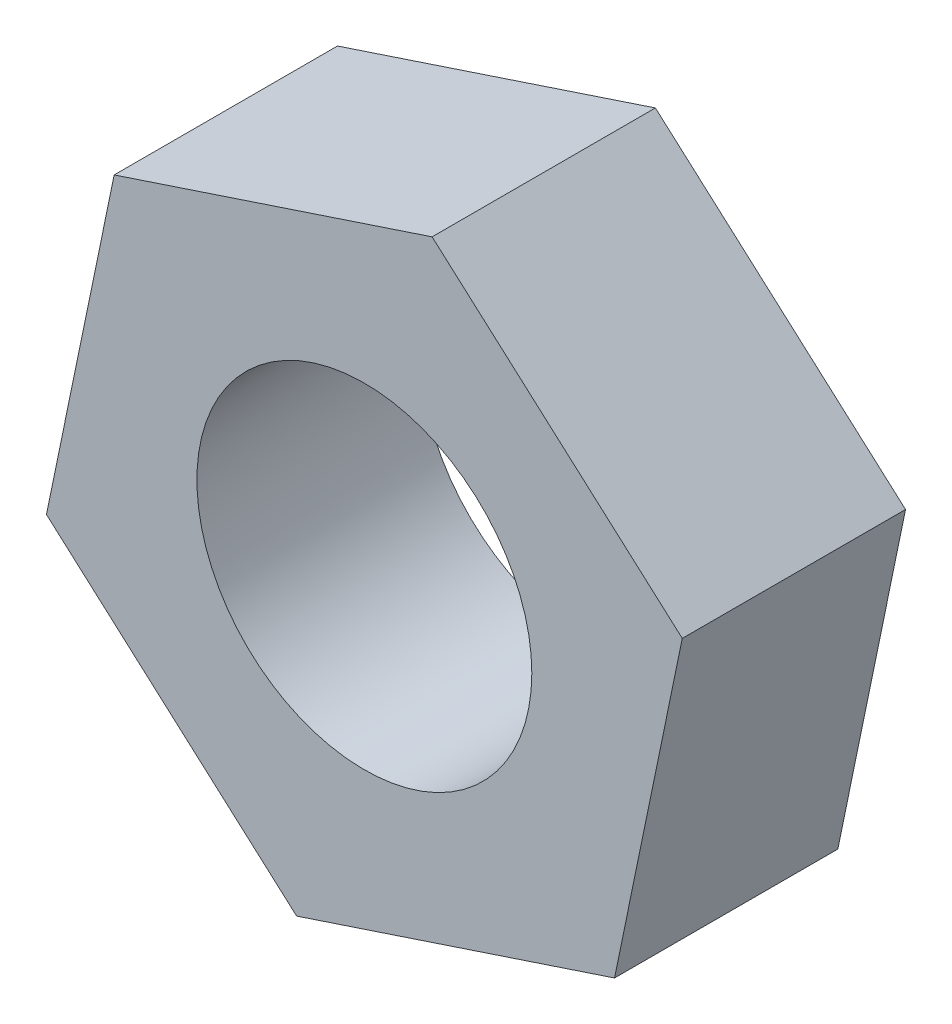
ISO-10303-21;
HEADER;
FILE_DESCRIPTION(('STEP AP214'),'2;1');
FILE_NAME('part.step','',(''),(''),'','','');
FILE_SCHEMA(('AUTOMOTIVE_DESIGN { 1 0 10303 214 1 1 1 1 }'));
ENDSEC;
DATA;
#1=APPLICATION_CONTEXT('core data for automotive mechanical design processes');
#2=APPLICATION_PROTOCOL_DEFINITION('international standard','automotive_design',2000,#1);
#3=PRODUCT_CONTEXT('',#1,'mechanical');
#4=PRODUCT('Part','Part','',(#3));
#5=PRODUCT_RELATED_PRODUCT_CATEGORY('part','',(#4));
#6=PRODUCT_DEFINITION_FORMATION('','',#4);
#7=PRODUCT_DEFINITION_CONTEXT('part definition',#1,'design');
#8=PRODUCT_DEFINITION('design','',#6,#7);
#9=PRODUCT_DEFINITION_SHAPE('','',#8);
#10=(LENGTH_UNIT() NAMED_UNIT(*) SI_UNIT(.MILLI.,.METRE.));
#11=(NAMED_UNIT(*) PLANE_ANGLE_UNIT() SI_UNIT($,.RADIAN.));
#12=(NAMED_UNIT(*) SI_UNIT($,.STERADIAN.) SOLID_ANGLE_UNIT());
#13=UNCERTAINTY_MEASURE_WITH_UNIT(LENGTH_MEASURE(1.E-05),#10,'distance_accuracy_value','');
#14=(GEOMETRIC_REPRESENTATION_CONTEXT(3) GLOBAL_UNCERTAINTY_ASSIGNED_CONTEXT((#13)) GLOBAL_UNIT_ASSIGNED_CONTEXT((#10,
#11,#12)) REPRESENTATION_CONTEXT('',''));
#15=CARTESIAN_POINT('',(0.,0.,0.));
#16=DIRECTION('',(0.,0.,1.));
#17=DIRECTION('',(1.,0.,0.));
#18=AXIS2_PLACEMENT_3D('',#15,#16,#17);
#19=CARTESIAN_POINT('',(-0.606830240659318,-2.93798520401675,2.));
#20=DIRECTION('',(0.,0.,1.));
#21=DIRECTION('',(1.,0.,0.));
#22=AXIS2_PLACEMENT_3D('',#19,#20,#21);
#23=PLANE('',#22);
#24=DIRECTION('',(0.746984900763885,-0.66484100206799,0.));
#25=VECTOR('',#24,1.);
#26=CARTESIAN_POINT('',(-2.84778494295097,-0.943462197812783,2.));
#27=LINE('',#26,#25);
#28=CARTESIAN_POINT('',(-2.84778494295097,-0.943462197812783,2.));
#29=VERTEX_POINT('',#28);
#30=CARTESIAN_POINT('',(-0.606830240659318,-2.93798520401675,2.));
#31=VERTEX_POINT('',#30);
#32=EDGE_CURVE('E126',#29,#31,#27,.T.);
#33=ORIENTED_EDGE('',*,*,#32,.T.);
#34=DIRECTION('',(0.949261647650324,0.314487399270927,0.));
#35=VECTOR('',#34,1.);
#36=CARTESIAN_POINT('',(-0.606830240659318,-2.93798520401675,2.));
#37=LINE('',#36,#35);
#38=CARTESIAN_POINT('',(2.24095470229165,-1.99452300620397,2.));
#39=VERTEX_POINT('',#38);
#40=EDGE_CURVE('E84',#31,#39,#37,.T.);
#41=ORIENTED_EDGE('',*,*,#40,.T.);
#42=DIRECTION('',(0.202276746886439,0.979328401338917,0.));
#43=VECTOR('',#42,1.);
#44=CARTESIAN_POINT('',(2.24095470229165,-1.99452300620397,2.));
#45=LINE('',#44,#43);
#46=CARTESIAN_POINT('',(2.84778494295097,0.943462197812782,2.));
#47=VERTEX_POINT('',#46);
#48=EDGE_CURVE('E97',#39,#47,#45,.T.);
#49=ORIENTED_EDGE('',*,*,#48,.T.);
#50=DIRECTION('',(-0.746984900763885,0.66484100206799,0.));
#51=VECTOR('',#50,1.);
#52=CARTESIAN_POINT('',(2.84778494295097,0.943462197812782,2.));
#53=LINE('',#52,#51);
#54=CARTESIAN_POINT('',(0.606830240659316,2.93798520401675,2.));
#55=VERTEX_POINT('',#54);
#56=EDGE_CURVE('E91',#47,#55,#53,.T.);
#57=ORIENTED_EDGE('',*,*,#56,.T.);
#58=DIRECTION('',(-0.949261647650324,-0.314487399270927,0.));
#59=VECTOR('',#58,1.);
#60=CARTESIAN_POINT('',(0.606830240659316,2.93798520401675,2.));
#61=LINE('',#60,#59);
#62=CARTESIAN_POINT('',(-2.24095470229165,1.99452300620397,2.));
#63=VERTEX_POINT('',#62);
#64=EDGE_CURVE('E95',#55,#63,#61,.T.);
#65=ORIENTED_EDGE('',*,*,#64,.T.);
#66=DIRECTION('',(-0.202276746886439,-0.979328401338917,0.));
#67=VECTOR('',#66,1.);
#68=CARTESIAN_POINT('',(-2.24095470229165,1.99452300620397,2.));
#69=LINE('',#68,#67);
#70=EDGE_CURVE('E47',#63,#29,#69,.T.);
#71=ORIENTED_EDGE('',*,*,#70,.T.);
#72=EDGE_LOOP('',(#33,#41,#49,#57,#65,#71));
#73=FACE_BOUND('',#72,.T.);
#74=CARTESIAN_POINT('',(0.,0.,2.));
#75=DIRECTION('',(0.,0.,1.));
#76=DIRECTION('',(1.,0.,0.));
#77=AXIS2_PLACEMENT_3D('',#74,#75,#76);
#78=CIRCLE('',#77,1.5);
#79=CARTESIAN_POINT('',(1.5,0.,2.));
#80=VERTEX_POINT('',#79);
#81=EDGE_CURVE('E119',#80,#80,#78,.T.);
#82=ORIENTED_EDGE('',*,*,#81,.F.);
#83=EDGE_LOOP('',(#82));
#84=FACE_BOUND('',#83,.T.);
#85=ADVANCED_FACE('F30',(#73,#84),#23,.T.);
#86=CARTESIAN_POINT('',(-0.606830240659318,-2.93798520401675,0.));
#87=DIRECTION('',(0.,0.,1.));
#88=DIRECTION('',(1.,0.,0.));
#89=AXIS2_PLACEMENT_3D('',#86,#87,#88);
#90=PLANE('',#89);
#91=DIRECTION('',(0.746984900763885,-0.66484100206799,0.));
#92=VECTOR('',#91,1.);
#93=CARTESIAN_POINT('',(-2.84778494295097,-0.943462197812783,0.));
#94=LINE('',#93,#92);
#95=CARTESIAN_POINT('',(-2.84778494295097,-0.943462197812783,0.));
#96=VERTEX_POINT('',#95);
#97=CARTESIAN_POINT('',(-0.606830240659318,-2.93798520401675,0.));
#98=VERTEX_POINT('',#97);
#99=EDGE_CURVE('E115',#96,#98,#94,.T.);
#100=ORIENTED_EDGE('',*,*,#99,.F.);
#101=DIRECTION('',(-0.202276746886439,-0.979328401338917,0.));
#102=VECTOR('',#101,1.);
#103=CARTESIAN_POINT('',(-2.24095470229165,1.99452300620397,0.));
#104=LINE('',#103,#102);
#105=CARTESIAN_POINT('',(-2.24095470229165,1.99452300620397,0.));
#106=VERTEX_POINT('',#105);
#107=EDGE_CURVE('E76',#106,#96,#104,.T.);
#108=ORIENTED_EDGE('',*,*,#107,.F.);
#109=DIRECTION('',(-0.949261647650324,-0.314487399270927,0.));
#110=VECTOR('',#109,1.);
#111=CARTESIAN_POINT('',(0.606830240659316,2.93798520401675,0.));
#112=LINE('',#111,#110);
#113=CARTESIAN_POINT('',(0.606830240659316,2.93798520401675,0.));
#114=VERTEX_POINT('',#113);
#115=EDGE_CURVE('E70',#114,#106,#112,.T.);
#116=ORIENTED_EDGE('',*,*,#115,.F.);
#117=DIRECTION('',(-0.746984900763885,0.66484100206799,0.));
#118=VECTOR('',#117,1.);
#119=CARTESIAN_POINT('',(2.84778494295097,0.943462197812782,0.));
#120=LINE('',#119,#118);
#121=CARTESIAN_POINT('',(2.84778494295097,0.943462197812782,0.));
#122=VERTEX_POINT('',#121);
#123=EDGE_CURVE('E105',#122,#114,#120,.T.);
#124=ORIENTED_EDGE('',*,*,#123,.F.);
#125=DIRECTION('',(0.202276746886439,0.979328401338917,0.));
#126=VECTOR('',#125,1.);
#127=CARTESIAN_POINT('',(2.24095470229165,-1.99452300620397,0.));
#128=LINE('',#127,#126);
#129=CARTESIAN_POINT('',(2.24095470229165,-1.99452300620397,0.));
#130=VERTEX_POINT('',#129);
#131=EDGE_CURVE('E121',#130,#122,#128,.T.);
#132=ORIENTED_EDGE('',*,*,#131,.F.);
#133=DIRECTION('',(0.949261647650324,0.314487399270927,0.));
#134=VECTOR('',#133,1.);
#135=CARTESIAN_POINT('',(-0.606830240659318,-2.93798520401675,0.));
#136=LINE('',#135,#134);
#137=EDGE_CURVE('E118',#98,#130,#136,.T.);
#138=ORIENTED_EDGE('',*,*,#137,.F.);
#139=EDGE_LOOP('',(#100,#108,#116,#124,#132,#138));
#140=FACE_BOUND('',#139,.T.);
#141=CARTESIAN_POINT('',(0.,0.,0.));
#142=DIRECTION('',(0.,0.,1.));
#143=DIRECTION('',(1.,0.,0.));
#144=AXIS2_PLACEMENT_3D('',#141,#142,#143);
#145=CIRCLE('',#144,1.5);
#146=CARTESIAN_POINT('',(1.5,0.,0.));
#147=VERTEX_POINT('',#146);
#148=EDGE_CURVE('E219',#147,#147,#145,.T.);
#149=ORIENTED_EDGE('',*,*,#148,.T.);
#150=EDGE_LOOP('',(#149));
#151=FACE_BOUND('',#150,.T.);
#152=ADVANCED_FACE('F135',(#140,#151),#90,.F.);
#153=CARTESIAN_POINT('',(-2.84778494295097,-0.943462197812783,2.));
#154=DIRECTION('',(0.66484100206799,0.746984900763885,0.));
#155=DIRECTION('',(-0.746984900763885,0.66484100206799,0.));
#156=AXIS2_PLACEMENT_3D('',#153,#154,#155);
#157=PLANE('',#156);
#158=ORIENTED_EDGE('',*,*,#99,.T.);
#159=DIRECTION('',(0.,0.,-1.));
#160=VECTOR('',#159,1.);
#161=CARTESIAN_POINT('',(-0.606830240659318,-2.93798520401675,2.));
#162=LINE('',#161,#160);
#163=EDGE_CURVE('E11',#31,#98,#162,.T.);
#164=ORIENTED_EDGE('',*,*,#163,.F.);
#165=ORIENTED_EDGE('',*,*,#32,.F.);
#166=DIRECTION('',(0.,0.,-1.));
#167=VECTOR('',#166,1.);
#168=CARTESIAN_POINT('',(-2.84778494295097,-0.943462197812783,2.));
#169=LINE('',#168,#167);
#170=EDGE_CURVE('E111',#29,#96,#169,.T.);
#171=ORIENTED_EDGE('',*,*,#170,.T.);
#172=EDGE_LOOP('',(#158,#164,#165,#171));
#173=FACE_BOUND('',#172,.T.);
#174=ADVANCED_FACE('F32',(#173),#157,.F.);
#175=CARTESIAN_POINT('',(-0.606830240659318,-2.93798520401675,2.));
#176=DIRECTION('',(-0.314487399270927,0.949261647650324,0.));
#177=DIRECTION('',(-0.949261647650324,-0.314487399270927,0.));
#178=AXIS2_PLACEMENT_3D('',#175,#176,#177);
#179=PLANE('',#178);
#180=ORIENTED_EDGE('',*,*,#137,.T.);
#181=DIRECTION('',(0.,0.,-1.));
#182=VECTOR('',#181,1.);
#183=CARTESIAN_POINT('',(2.24095470229165,-1.99452300620397,2.));
#184=LINE('',#183,#182);
#185=EDGE_CURVE('E39',#39,#130,#184,.T.);
#186=ORIENTED_EDGE('',*,*,#185,.F.);
#187=ORIENTED_EDGE('',*,*,#40,.F.);
#188=ORIENTED_EDGE('',*,*,#163,.T.);
#189=EDGE_LOOP('',(#180,#186,#187,#188));
#190=FACE_BOUND('',#189,.T.);
#191=ADVANCED_FACE('F160',(#190),#179,.F.);
#192=CARTESIAN_POINT('',(2.24095470229165,-1.99452300620397,2.));
#193=DIRECTION('',(-0.979328401338917,0.202276746886439,0.));
#194=DIRECTION('',(-0.202276746886439,-0.979328401338917,0.));
#195=AXIS2_PLACEMENT_3D('',#192,#193,#194);
#196=PLANE('',#195);
#197=ORIENTED_EDGE('',*,*,#131,.T.);
#198=DIRECTION('',(0.,0.,-1.));
#199=VECTOR('',#198,1.);
#200=CARTESIAN_POINT('',(2.84778494295097,0.943462197812782,2.));
#201=LINE('',#200,#199);
#202=EDGE_CURVE('E106',#47,#122,#201,.T.);
#203=ORIENTED_EDGE('',*,*,#202,.F.);
#204=ORIENTED_EDGE('',*,*,#48,.F.);
#205=ORIENTED_EDGE('',*,*,#185,.T.);
#206=EDGE_LOOP('',(#197,#203,#204,#205));
#207=FACE_BOUND('',#206,.T.);
#208=ADVANCED_FACE('F132',(#207),#196,.F.);
#209=CARTESIAN_POINT('',(2.84778494295097,0.943462197812782,2.));
#210=DIRECTION('',(-0.66484100206799,-0.746984900763885,0.));
#211=DIRECTION('',(0.746984900763885,-0.66484100206799,0.));
#212=AXIS2_PLACEMENT_3D('',#209,#210,#211);
#213=PLANE('',#212);
#214=ORIENTED_EDGE('',*,*,#123,.T.);
#215=DIRECTION('',(0.,0.,-1.));
#216=VECTOR('',#215,1.);
#217=CARTESIAN_POINT('',(0.606830240659316,2.93798520401675,2.));
#218=LINE('',#217,#216);
#219=EDGE_CURVE('E102',#55,#114,#218,.T.);
#220=ORIENTED_EDGE('',*,*,#219,.F.);
#221=ORIENTED_EDGE('',*,*,#56,.F.);
#222=ORIENTED_EDGE('',*,*,#202,.T.);
#223=EDGE_LOOP('',(#214,#220,#221,#222));
#224=FACE_BOUND('',#223,.T.);
#225=ADVANCED_FACE('F103',(#224),#213,.F.);
#226=CARTESIAN_POINT('',(0.606830240659316,2.93798520401675,2.));
#227=DIRECTION('',(0.314487399270928,-0.949261647650324,0.));
#228=DIRECTION('',(0.949261647650324,0.314487399270928,0.));
#229=AXIS2_PLACEMENT_3D('',#226,#227,#228);
#230=PLANE('',#229);
#231=ORIENTED_EDGE('',*,*,#115,.T.);
#232=DIRECTION('',(0.,0.,-1.));
#233=VECTOR('',#232,1.);
#234=CARTESIAN_POINT('',(-2.24095470229165,1.99452300620397,2.));
#235=LINE('',#234,#233);
#236=EDGE_CURVE('E107',#63,#106,#235,.T.);
#237=ORIENTED_EDGE('',*,*,#236,.F.);
#238=ORIENTED_EDGE('',*,*,#64,.F.);
#239=ORIENTED_EDGE('',*,*,#219,.T.);
#240=EDGE_LOOP('',(#231,#237,#238,#239));
#241=FACE_BOUND('',#240,.T.);
#242=ADVANCED_FACE('F109',(#241),#230,.F.);
#243=CARTESIAN_POINT('',(-2.24095470229165,1.99452300620397,2.));
#244=DIRECTION('',(0.979328401338917,-0.202276746886439,0.));
#245=DIRECTION('',(0.202276746886439,0.979328401338917,0.));
#246=AXIS2_PLACEMENT_3D('',#243,#244,#245);
#247=PLANE('',#246);
#248=ORIENTED_EDGE('',*,*,#107,.T.);
#249=ORIENTED_EDGE('',*,*,#170,.F.);
#250=ORIENTED_EDGE('',*,*,#70,.F.);
#251=ORIENTED_EDGE('',*,*,#236,.T.);
#252=EDGE_LOOP('',(#248,#249,#250,#251));
#253=FACE_BOUND('',#252,.T.);
#254=ADVANCED_FACE('F140',(#253),#247,.F.);
#255=CARTESIAN_POINT('',(0.,0.,2.));
#256=DIRECTION('',(0.,0.,-1.));
#257=DIRECTION('',(-1.,0.,0.));
#258=AXIS2_PLACEMENT_3D('',#255,#256,#257);
#259=CYLINDRICAL_SURFACE('',#258,1.5);
#260=ORIENTED_EDGE('',*,*,#81,.T.);
#261=EDGE_LOOP('',(#260));
#262=FACE_BOUND('',#261,.T.);
#263=ORIENTED_EDGE('',*,*,#148,.F.);
#264=EDGE_LOOP('',(#263));
#265=FACE_BOUND('',#264,.T.);
#266=ADVANCED_FACE('F142',(#262,#265),#259,.F.);
#267=CLOSED_SHELL('',(#85,#152,#174,#191,#208,#225,#242,#254,#266));
#268=MANIFOLD_SOLID_BREP('B2',#267);
#269=ADVANCED_BREP_SHAPE_REPRESENTATION('',(#18,#268),#14);
#270=SHAPE_DEFINITION_REPRESENTATION(#9,#269);
ENDSEC;
END-ISO-10303-21;
